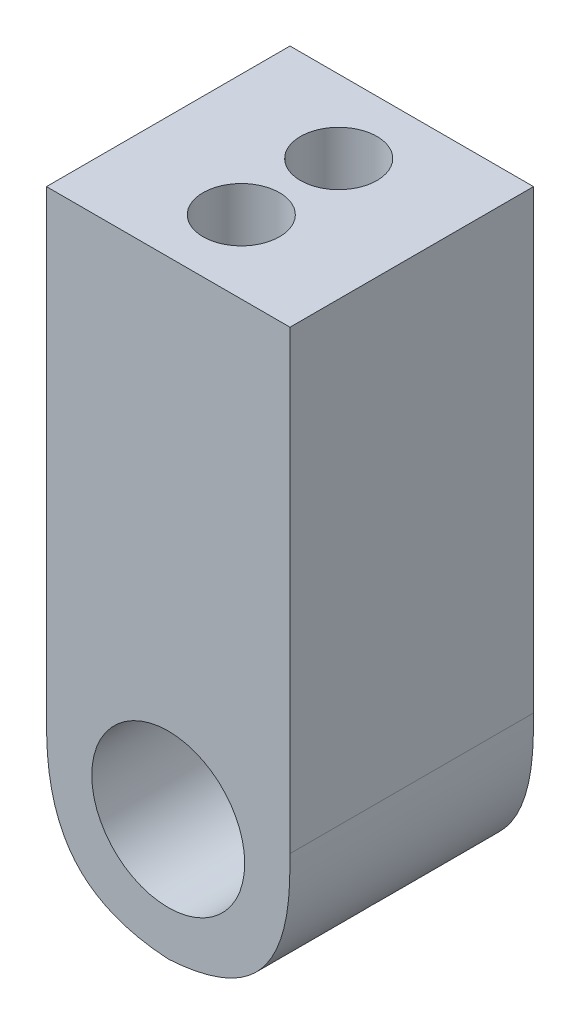
ISO-10303-21;
HEADER;
FILE_DESCRIPTION(('STEP AP214'),'2;1');
FILE_NAME('part.step','',(''),(''),'','','');
FILE_SCHEMA(('AUTOMOTIVE_DESIGN { 1 0 10303 214 1 1 1 1 }'));
ENDSEC;
DATA;
#1=APPLICATION_CONTEXT('core data for automotive mechanical design processes');
#2=APPLICATION_PROTOCOL_DEFINITION('international standard','automotive_design',2000,#1);
#3=PRODUCT_CONTEXT('',#1,'mechanical');
#4=PRODUCT('Part','Part','',(#3));
#5=PRODUCT_RELATED_PRODUCT_CATEGORY('part','',(#4));
#6=PRODUCT_DEFINITION_FORMATION('','',#4);
#7=PRODUCT_DEFINITION_CONTEXT('part definition',#1,'design');
#8=PRODUCT_DEFINITION('design','',#6,#7);
#9=PRODUCT_DEFINITION_SHAPE('','',#8);
#10=(LENGTH_UNIT() NAMED_UNIT(*) SI_UNIT(.MILLI.,.METRE.));
#11=(NAMED_UNIT(*) PLANE_ANGLE_UNIT() SI_UNIT($,.RADIAN.));
#12=(NAMED_UNIT(*) SI_UNIT($,.STERADIAN.) SOLID_ANGLE_UNIT());
#13=UNCERTAINTY_MEASURE_WITH_UNIT(LENGTH_MEASURE(1.E-05),#10,'distance_accuracy_value','');
#14=(GEOMETRIC_REPRESENTATION_CONTEXT(3) GLOBAL_UNCERTAINTY_ASSIGNED_CONTEXT((#13)) GLOBAL_UNIT_ASSIGNED_CONTEXT((#10,
#11,#12)) REPRESENTATION_CONTEXT('',''));
#15=CARTESIAN_POINT('',(0.,0.,0.));
#16=DIRECTION('',(0.,0.,1.));
#17=DIRECTION('',(1.,0.,0.));
#18=AXIS2_PLACEMENT_3D('',#15,#16,#17);
#19=CARTESIAN_POINT('',(-6.35,0.,-12.7));
#20=DIRECTION('',(1.,0.,0.));
#21=DIRECTION('',(0.,0.,-1.));
#22=AXIS2_PLACEMENT_3D('',#19,#20,#21);
#23=PLANE('',#22);
#24=DIRECTION('',(0.,1.,0.));
#25=VECTOR('',#24,1.);
#26=CARTESIAN_POINT('',(-6.35,0.,-12.7));
#27=LINE('',#26,#25);
#28=CARTESIAN_POINT('',(-6.35,1.6256,-12.7));
#29=VERTEX_POINT('',#28);
#30=CARTESIAN_POINT('',(-6.35,25.4,-12.7));
#31=VERTEX_POINT('',#30);
#32=EDGE_CURVE('E105',#29,#31,#27,.T.);
#33=ORIENTED_EDGE('',*,*,#32,.F.);
#34=CARTESIAN_POINT('',(-6.35,1.6256,0.635));
#35=CARTESIAN_POINT('',(-6.35,1.6256,-4.02166666666667));
#36=CARTESIAN_POINT('',(-6.35,1.6256,-8.67833333332475));
#37=CARTESIAN_POINT('',(-6.35,1.6256,-13.335));
#38=B_SPLINE_CURVE_WITH_KNOTS('',3,(#34,#35,#36,#37),.UNSPECIFIED.,.F.,.F.,(4,4),(-0.013335,
0.000635),.UNSPECIFIED.);
#39=CARTESIAN_POINT('',(-6.35,1.6256,0.));
#40=VERTEX_POINT('',#39);
#41=EDGE_CURVE('E122',#29,#40,#38,.F.);
#42=ORIENTED_EDGE('',*,*,#41,.T.);
#43=DIRECTION('',(0.,1.,0.));
#44=VECTOR('',#43,1.);
#45=CARTESIAN_POINT('',(-6.35,0.,0.));
#46=LINE('',#45,#44);
#47=CARTESIAN_POINT('',(-6.35,25.4,0.));
#48=VERTEX_POINT('',#47);
#49=EDGE_CURVE('E126',#40,#48,#46,.T.);
#50=ORIENTED_EDGE('',*,*,#49,.T.);
#51=DIRECTION('',(0.,0.,1.));
#52=VECTOR('',#51,1.);
#53=CARTESIAN_POINT('',(-6.35,25.4,-12.7));
#54=LINE('',#53,#52);
#55=EDGE_CURVE('E119',#31,#48,#54,.T.);
#56=ORIENTED_EDGE('',*,*,#55,.F.);
#57=EDGE_LOOP('',(#33,#42,#50,#56));
#58=FACE_BOUND('',#57,.T.);
#59=ADVANCED_FACE('F44',(#58),#23,.F.);
#60=CARTESIAN_POINT('',(0.,25.4,-12.7));
#61=DIRECTION('',(0.,-1.,0.));
#62=DIRECTION('',(0.,0.,-1.));
#63=AXIS2_PLACEMENT_3D('',#60,#61,#62);
#64=PLANE('',#63);
#65=CARTESIAN_POINT('',(0.,25.4,-8.89));
#66=DIRECTION('',(0.,1.,0.));
#67=DIRECTION('',(0.,0.,1.));
#68=AXIS2_PLACEMENT_3D('',#65,#66,#67);
#69=CIRCLE('',#68,1.9939);
#70=CARTESIAN_POINT('',(0.,25.4,-6.8961));
#71=VERTEX_POINT('',#70);
#72=EDGE_CURVE('E189',#71,#71,#69,.T.);
#73=ORIENTED_EDGE('',*,*,#72,.F.);
#74=EDGE_LOOP('',(#73));
#75=FACE_BOUND('',#74,.T.);
#76=CARTESIAN_POINT('',(0.,25.4,-3.81));
#77=DIRECTION('',(0.,1.,0.));
#78=DIRECTION('',(0.,0.,1.));
#79=AXIS2_PLACEMENT_3D('',#76,#77,#78);
#80=CIRCLE('',#79,1.9939);
#81=CARTESIAN_POINT('',(0.,25.4,-1.8161));
#82=VERTEX_POINT('',#81);
#83=EDGE_CURVE('E180',#82,#82,#80,.T.);
#84=ORIENTED_EDGE('',*,*,#83,.F.);
#85=EDGE_LOOP('',(#84));
#86=FACE_BOUND('',#85,.T.);
#87=DIRECTION('',(1.,0.,0.));
#88=VECTOR('',#87,1.);
#89=CARTESIAN_POINT('',(0.,25.4,0.));
#90=LINE('',#89,#88);
#91=CARTESIAN_POINT('',(6.35,25.4,0.));
#92=VERTEX_POINT('',#91);
#93=EDGE_CURVE('E117',#48,#92,#90,.T.);
#94=ORIENTED_EDGE('',*,*,#93,.T.);
#95=DIRECTION('',(0.,0.,1.));
#96=VECTOR('',#95,1.);
#97=CARTESIAN_POINT('',(6.35,25.4,-12.7));
#98=LINE('',#97,#96);
#99=CARTESIAN_POINT('',(6.35,25.4,-12.7));
#100=VERTEX_POINT('',#99);
#101=EDGE_CURVE('E101',#100,#92,#98,.T.);
#102=ORIENTED_EDGE('',*,*,#101,.F.);
#103=DIRECTION('',(1.,0.,0.));
#104=VECTOR('',#103,1.);
#105=CARTESIAN_POINT('',(0.,25.4,-12.7));
#106=LINE('',#105,#104);
#107=EDGE_CURVE('E104',#31,#100,#106,.T.);
#108=ORIENTED_EDGE('',*,*,#107,.F.);
#109=ORIENTED_EDGE('',*,*,#55,.T.);
#110=EDGE_LOOP('',(#94,#102,#108,#109));
#111=FACE_BOUND('',#110,.T.);
#112=ADVANCED_FACE('F115',(#75,#86,#111),#64,.F.);
#113=CARTESIAN_POINT('',(6.35,0.,-12.7));
#114=DIRECTION('',(1.,0.,0.));
#115=DIRECTION('',(0.,0.,-1.));
#116=AXIS2_PLACEMENT_3D('',#113,#114,#115);
#117=PLANE('',#116);
#118=DIRECTION('',(0.,1.,0.));
#119=VECTOR('',#118,1.);
#120=CARTESIAN_POINT('',(6.35,0.,0.));
#121=LINE('',#120,#119);
#122=CARTESIAN_POINT('',(6.35,1.6256,0.));
#123=VERTEX_POINT('',#122);
#124=EDGE_CURVE('E130',#123,#92,#121,.T.);
#125=ORIENTED_EDGE('',*,*,#124,.F.);
#126=CARTESIAN_POINT('',(6.35,1.6256,-13.335));
#127=CARTESIAN_POINT('',(6.35,1.6256,-8.67833333332475));
#128=CARTESIAN_POINT('',(6.35,1.6256,-4.02166666666667));
#129=CARTESIAN_POINT('',(6.35,1.6256,0.634999999999998));
#130=B_SPLINE_CURVE_WITH_KNOTS('',3,(#126,#127,#128,#129),.UNSPECIFIED.,.F.,.F.,(4,4),
(-0.000635,0.013335),.UNSPECIFIED.);
#131=CARTESIAN_POINT('',(6.35,1.6256,-12.7));
#132=VERTEX_POINT('',#131);
#133=EDGE_CURVE('E11',#123,#132,#130,.F.);
#134=ORIENTED_EDGE('',*,*,#133,.T.);
#135=DIRECTION('',(0.,1.,0.));
#136=VECTOR('',#135,1.);
#137=CARTESIAN_POINT('',(6.35,0.,-12.7));
#138=LINE('',#137,#136);
#139=EDGE_CURVE('E97',#132,#100,#138,.T.);
#140=ORIENTED_EDGE('',*,*,#139,.T.);
#141=ORIENTED_EDGE('',*,*,#101,.T.);
#142=EDGE_LOOP('',(#125,#134,#140,#141));
#143=FACE_BOUND('',#142,.T.);
#144=ADVANCED_FACE('F99',(#143),#117,.T.);
#145=CARTESIAN_POINT('',(0.,0.,-12.7));
#146=DIRECTION('',(0.,0.,1.));
#147=DIRECTION('',(1.,0.,0.));
#148=AXIS2_PLACEMENT_3D('',#145,#146,#147);
#149=PLANE('',#148);
#150=CARTESIAN_POINT('',(-1.6256,-6.35,-12.7));
#151=CARTESIAN_POINT('',(-0.284119620185859,-6.35,-12.7));
#152=CARTESIAN_POINT('',(1.05736075962828,-6.35,-12.7));
#153=CARTESIAN_POINT('',(4.01400084403143,-5.77821392415533,-12.7));
#154=CARTESIAN_POINT('',(5.77821392415533,-4.01400084403143,-12.7));
#155=CARTESIAN_POINT('',(6.35,-1.05736075962829,-12.7));
#156=CARTESIAN_POINT('',(6.35,0.284119620185857,-12.7));
#157=CARTESIAN_POINT('',(6.35,1.6256,-12.7));
#158=B_SPLINE_CURVE_WITH_KNOTS('',5,(#150,#151,#152,#153,#154,#155,#156,#157),.UNSPECIFIED.,.F.,
.F.,(6,2,6),(0.,0.5,1.),.UNSPECIFIED.);
#159=CARTESIAN_POINT('',(-7.25062341599403E-07,-6.3144499642676,-12.7));
#160=VERTEX_POINT('',#159);
#161=EDGE_CURVE('E66',#132,#160,#158,.F.);
#162=ORIENTED_EDGE('',*,*,#161,.T.);
#163=CARTESIAN_POINT('',(-6.35,1.6256,-12.7));
#164=CARTESIAN_POINT('',(-6.35,0.284119620185856,-12.7));
#165=CARTESIAN_POINT('',(-6.35,-1.05736075962829,-12.7));
#166=CARTESIAN_POINT('',(-5.77821392415534,-4.01400084403143,-12.7));
#167=CARTESIAN_POINT('',(-4.01400084403143,-5.77821392415533,-12.7));
#168=CARTESIAN_POINT('',(-1.05736075962829,-6.35,-12.7));
#169=CARTESIAN_POINT('',(0.284119620185855,-6.35,-12.7));
#170=CARTESIAN_POINT('',(1.6256,-6.35,-12.7));
#171=B_SPLINE_CURVE_WITH_KNOTS('',5,(#163,#164,#165,#166,#167,#168,#169,#170),.UNSPECIFIED.,.F.,
.F.,(6,2,6),(0.,0.5,1.),.UNSPECIFIED.);
#172=EDGE_CURVE('E59',#160,#29,#171,.F.);
#173=ORIENTED_EDGE('',*,*,#172,.T.);
#174=ORIENTED_EDGE('',*,*,#32,.T.);
#175=ORIENTED_EDGE('',*,*,#107,.T.);
#176=ORIENTED_EDGE('',*,*,#139,.F.);
#177=EDGE_LOOP('',(#162,#173,#174,#175,#176));
#178=FACE_BOUND('',#177,.T.);
#179=ADVANCED_FACE('F108',(#178),#149,.F.);
#180=CARTESIAN_POINT('',(0.,0.,0.));
#181=DIRECTION('',(0.,0.,1.));
#182=DIRECTION('',(1.,0.,0.));
#183=AXIS2_PLACEMENT_3D('',#180,#181,#182);
#184=PLANE('',#183);
#185=CARTESIAN_POINT('',(0.,0.,0.));
#186=DIRECTION('',(0.,0.,1.));
#187=DIRECTION('',(1.,0.,0.));
#188=AXIS2_PLACEMENT_3D('',#185,#186,#187);
#189=CIRCLE('',#188,3.9878);
#190=CARTESIAN_POINT('',(3.9878,0.,0.));
#191=VERTEX_POINT('',#190);
#192=EDGE_CURVE('E197',#191,#191,#189,.T.);
#193=ORIENTED_EDGE('',*,*,#192,.F.);
#194=EDGE_LOOP('',(#193));
#195=FACE_BOUND('',#194,.T.);
#196=ORIENTED_EDGE('',*,*,#49,.F.);
#197=CARTESIAN_POINT('',(1.6256,-6.35,0.));
#198=CARTESIAN_POINT('',(0.284119620185855,-6.35,0.));
#199=CARTESIAN_POINT('',(-1.05736075962829,-6.35,0.));
#200=CARTESIAN_POINT('',(-4.01400084403143,-5.77821392415533,0.));
#201=CARTESIAN_POINT('',(-5.77821392415534,-4.01400084403143,0.));
#202=CARTESIAN_POINT('',(-6.35,-1.05736075962829,0.));
#203=CARTESIAN_POINT('',(-6.35,0.284119620185856,0.));
#204=CARTESIAN_POINT('',(-6.35,1.6256,0.));
#205=B_SPLINE_CURVE_WITH_KNOTS('',5,(#197,#198,#199,#200,#201,#202,#203,#204),.UNSPECIFIED.,.F.,
.F.,(6,2,6),(0.,0.5,1.),.UNSPECIFIED.);
#206=CARTESIAN_POINT('',(-4.50984004952076E-07,-6.31445417406303,0.));
#207=VERTEX_POINT('',#206);
#208=EDGE_CURVE('E214',#40,#207,#205,.F.);
#209=ORIENTED_EDGE('',*,*,#208,.T.);
#210=CARTESIAN_POINT('',(6.35,1.6256,0.));
#211=CARTESIAN_POINT('',(6.35,0.284119620185857,0.));
#212=CARTESIAN_POINT('',(6.35,-1.05736075962829,0.));
#213=CARTESIAN_POINT('',(5.77821392415533,-4.01400084403143,0.));
#214=CARTESIAN_POINT('',(4.01400084403143,-5.77821392415533,0.));
#215=CARTESIAN_POINT('',(1.05736075962828,-6.35,0.));
#216=CARTESIAN_POINT('',(-0.284119620185859,-6.35,0.));
#217=CARTESIAN_POINT('',(-1.6256,-6.35,0.));
#218=B_SPLINE_CURVE_WITH_KNOTS('',5,(#210,#211,#212,#213,#214,#215,#216,#217),.UNSPECIFIED.,.F.,
.F.,(6,2,6),(0.,0.5,1.),.UNSPECIFIED.);
#219=EDGE_CURVE('E148',#207,#123,#218,.F.);
#220=ORIENTED_EDGE('',*,*,#219,.T.);
#221=ORIENTED_EDGE('',*,*,#124,.T.);
#222=ORIENTED_EDGE('',*,*,#93,.F.);
#223=EDGE_LOOP('',(#196,#209,#220,#221,#222));
#224=FACE_BOUND('',#223,.T.);
#225=ADVANCED_FACE('F154',(#195,#224),#184,.T.);
#226=CARTESIAN_POINT('',(-1.6256,-6.35,-13.335));
#227=CARTESIAN_POINT('',(-1.6256,-6.35,-8.67833333332475));
#228=CARTESIAN_POINT('',(-1.6256,-6.35,-4.02166666666667));
#229=CARTESIAN_POINT('',(-1.6256,-6.35,0.634999999999998));
#230=CARTESIAN_POINT('',(-0.284119620185859,-6.35,-13.335));
#231=CARTESIAN_POINT('',(-0.284119620185859,-6.35,-8.67833333332475));
#232=CARTESIAN_POINT('',(-0.284119620185859,-6.35,-4.02166666666667));
#233=CARTESIAN_POINT('',(-0.284119620185859,-6.35,0.634999999999998));
#234=CARTESIAN_POINT('',(1.05736075962828,-6.35,-13.335));
#235=CARTESIAN_POINT('',(1.05736075962828,-6.35,-8.67833333332475));
#236=CARTESIAN_POINT('',(1.05736075962828,-6.35,-4.02166666666667));
#237=CARTESIAN_POINT('',(1.05736075962828,-6.35,0.634999999999998));
#238=CARTESIAN_POINT('',(4.01400084403143,-5.77821392415533,-13.335));
#239=CARTESIAN_POINT('',(4.01400084403143,-5.77821392415533,-8.67833333332475));
#240=CARTESIAN_POINT('',(4.01400084403143,-5.77821392415533,-4.02166666666667));
#241=CARTESIAN_POINT('',(4.01400084403143,-5.77821392415533,0.634999999999998));
#242=CARTESIAN_POINT('',(5.77821392415533,-4.01400084403143,-13.335));
#243=CARTESIAN_POINT('',(5.77821392415533,-4.01400084403143,-8.67833333332475));
#244=CARTESIAN_POINT('',(5.77821392415533,-4.01400084403143,-4.02166666666667));
#245=CARTESIAN_POINT('',(5.77821392415533,-4.01400084403143,0.634999999999998));
#246=CARTESIAN_POINT('',(6.35,-1.05736075962829,-13.335));
#247=CARTESIAN_POINT('',(6.35,-1.05736075962829,-8.67833333332475));
#248=CARTESIAN_POINT('',(6.35,-1.05736075962829,-4.02166666666667));
#249=CARTESIAN_POINT('',(6.35,-1.05736075962829,0.634999999999998));
#250=CARTESIAN_POINT('',(6.35,0.284119620185857,-13.335));
#251=CARTESIAN_POINT('',(6.35,0.284119620185857,-8.67833333332475));
#252=CARTESIAN_POINT('',(6.35,0.284119620185857,-4.02166666666667));
#253=CARTESIAN_POINT('',(6.35,0.284119620185857,0.634999999999998));
#254=CARTESIAN_POINT('',(6.35,1.6256,-13.335));
#255=CARTESIAN_POINT('',(6.35,1.6256,-8.67833333332475));
#256=CARTESIAN_POINT('',(6.35,1.6256,-4.02166666666667));
#257=CARTESIAN_POINT('',(6.35,1.6256,0.634999999999998));
#258=B_SPLINE_SURFACE_WITH_KNOTS('',5,3,((#226,#227,#228,#229),(#230,#231,#232,#233),(#234,#235,
#236,#237),(#238,#239,#240,#241),(#242,#243,#244,#245),(#246,#247,#248,#249),(#250,#251,#252,
#253),(#254,#255,#256,#257)),.UNSPECIFIED.,.F.,.F.,.F.,(6,2,6),(4,4),(0.,0.5,1.),(-0.000635,
0.013335),.UNSPECIFIED.);
#259=CARTESIAN_POINT('',(0.,-6.31446149156776,-13.335));
#260=CARTESIAN_POINT('',(0.,-6.31446149156776,-8.67833333332475));
#261=CARTESIAN_POINT('',(0.,-6.31446149156776,-4.02166666666667));
#262=CARTESIAN_POINT('',(0.,-6.31446149156776,0.635));
#263=B_SPLINE_CURVE_WITH_KNOTS('',3,(#259,#260,#261,#262),.UNSPECIFIED.,.F.,.F.,(4,4),
(-0.013335,0.000635),.UNSPECIFIED.);
#264=EDGE_CURVE('E131',#160,#207,#263,.T.);
#265=ORIENTED_EDGE('',*,*,#264,.F.);
#266=ORIENTED_EDGE('',*,*,#161,.F.);
#267=ORIENTED_EDGE('',*,*,#133,.F.);
#268=ORIENTED_EDGE('',*,*,#219,.F.);
#269=EDGE_LOOP('',(#265,#266,#267,#268));
#270=FACE_BOUND('',#269,.T.);
#271=ADVANCED_FACE('F47',(#270),#258,.T.);
#272=CARTESIAN_POINT('',(1.6256,-6.35,0.635));
#273=CARTESIAN_POINT('',(1.6256,-6.35,-4.02166666666667));
#274=CARTESIAN_POINT('',(1.6256,-6.35,-8.67833333332475));
#275=CARTESIAN_POINT('',(1.6256,-6.35,-13.335));
#276=CARTESIAN_POINT('',(0.284119620185855,-6.35,0.635));
#277=CARTESIAN_POINT('',(0.284119620185855,-6.35,-4.02166666666667));
#278=CARTESIAN_POINT('',(0.284119620185855,-6.35,-8.67833333332475));
#279=CARTESIAN_POINT('',(0.284119620185855,-6.35,-13.335));
#280=CARTESIAN_POINT('',(-1.05736075962829,-6.35,0.635));
#281=CARTESIAN_POINT('',(-1.05736075962829,-6.35,-4.02166666666667));
#282=CARTESIAN_POINT('',(-1.05736075962829,-6.35,-8.67833333332475));
#283=CARTESIAN_POINT('',(-1.05736075962829,-6.35,-13.335));
#284=CARTESIAN_POINT('',(-4.01400084403143,-5.77821392415533,0.635));
#285=CARTESIAN_POINT('',(-4.01400084403143,-5.77821392415533,-4.02166666666667));
#286=CARTESIAN_POINT('',(-4.01400084403143,-5.77821392415533,-8.67833333332475));
#287=CARTESIAN_POINT('',(-4.01400084403143,-5.77821392415533,-13.335));
#288=CARTESIAN_POINT('',(-5.77821392415534,-4.01400084403143,0.635));
#289=CARTESIAN_POINT('',(-5.77821392415534,-4.01400084403143,-4.02166666666667));
#290=CARTESIAN_POINT('',(-5.77821392415534,-4.01400084403143,-8.67833333332475));
#291=CARTESIAN_POINT('',(-5.77821392415534,-4.01400084403143,-13.335));
#292=CARTESIAN_POINT('',(-6.35,-1.05736075962829,0.635));
#293=CARTESIAN_POINT('',(-6.35,-1.05736075962829,-4.02166666666667));
#294=CARTESIAN_POINT('',(-6.35,-1.05736075962829,-8.67833333332475));
#295=CARTESIAN_POINT('',(-6.35,-1.05736075962829,-13.335));
#296=CARTESIAN_POINT('',(-6.35,0.284119620185856,0.635));
#297=CARTESIAN_POINT('',(-6.35,0.284119620185856,-4.02166666666667));
#298=CARTESIAN_POINT('',(-6.35,0.284119620185856,-8.67833333332475));
#299=CARTESIAN_POINT('',(-6.35,0.284119620185856,-13.335));
#300=CARTESIAN_POINT('',(-6.35,1.6256,0.635));
#301=CARTESIAN_POINT('',(-6.35,1.6256,-4.02166666666667));
#302=CARTESIAN_POINT('',(-6.35,1.6256,-8.67833333332475));
#303=CARTESIAN_POINT('',(-6.35,1.6256,-13.335));
#304=B_SPLINE_SURFACE_WITH_KNOTS('',5,3,((#272,#273,#274,#275),(#276,#277,#278,#279),(#280,#281,
#282,#283),(#284,#285,#286,#287),(#288,#289,#290,#291),(#292,#293,#294,#295),(#296,#297,#298,
#299),(#300,#301,#302,#303)),.UNSPECIFIED.,.F.,.F.,.F.,(6,2,6),(4,4),(0.,0.5,1.),(-0.013335,
0.000635),.UNSPECIFIED.);
#305=ORIENTED_EDGE('',*,*,#172,.F.);
#306=ORIENTED_EDGE('',*,*,#264,.T.);
#307=ORIENTED_EDGE('',*,*,#208,.F.);
#308=ORIENTED_EDGE('',*,*,#41,.F.);
#309=EDGE_LOOP('',(#305,#306,#307,#308));
#310=FACE_BOUND('',#309,.T.);
#311=ADVANCED_FACE('F254',(#310),#304,.T.);
#312=CARTESIAN_POINT('',(0.,19.05,-3.81));
#313=DIRECTION('',(0.,1.,0.));
#314=DIRECTION('',(0.,0.,1.));
#315=AXIS2_PLACEMENT_3D('',#312,#313,#314);
#316=CYLINDRICAL_SURFACE('',#315,1.9939);
#317=CARTESIAN_POINT('',(0.,19.05,-3.81));
#318=DIRECTION('',(0.,1.,0.));
#319=DIRECTION('',(0.,0.,1.));
#320=AXIS2_PLACEMENT_3D('',#317,#318,#319);
#321=CIRCLE('',#320,1.9939);
#322=CARTESIAN_POINT('',(0.,19.05,-1.8161));
#323=VERTEX_POINT('',#322);
#324=EDGE_CURVE('E184',#323,#323,#321,.T.);
#325=ORIENTED_EDGE('',*,*,#324,.F.);
#326=EDGE_LOOP('',(#325));
#327=FACE_BOUND('',#326,.T.);
#328=ORIENTED_EDGE('',*,*,#83,.T.);
#329=EDGE_LOOP('',(#328));
#330=FACE_BOUND('',#329,.T.);
#331=ADVANCED_FACE('F261',(#327,#330),#316,.F.);
#332=CARTESIAN_POINT('',(0.,19.05,0.));
#333=DIRECTION('',(0.,1.,0.));
#334=DIRECTION('',(0.,0.,1.));
#335=AXIS2_PLACEMENT_3D('',#332,#333,#334);
#336=PLANE('',#335);
#337=ORIENTED_EDGE('',*,*,#324,.T.);
#338=EDGE_LOOP('',(#337));
#339=FACE_BOUND('',#338,.T.);
#340=ADVANCED_FACE('F338',(#339),#336,.T.);
#341=CARTESIAN_POINT('',(0.,19.05,-8.89));
#342=DIRECTION('',(0.,1.,0.));
#343=DIRECTION('',(0.,0.,1.));
#344=AXIS2_PLACEMENT_3D('',#341,#342,#343);
#345=CYLINDRICAL_SURFACE('',#344,1.9939);
#346=CARTESIAN_POINT('',(0.,19.05,-8.89));
#347=DIRECTION('',(0.,1.,0.));
#348=DIRECTION('',(0.,0.,1.));
#349=AXIS2_PLACEMENT_3D('',#346,#347,#348);
#350=CIRCLE('',#349,1.9939);
#351=CARTESIAN_POINT('',(0.,19.05,-6.8961));
#352=VERTEX_POINT('',#351);
#353=EDGE_CURVE('E193',#352,#352,#350,.T.);
#354=ORIENTED_EDGE('',*,*,#353,.F.);
#355=EDGE_LOOP('',(#354));
#356=FACE_BOUND('',#355,.T.);
#357=ORIENTED_EDGE('',*,*,#72,.T.);
#358=EDGE_LOOP('',(#357));
#359=FACE_BOUND('',#358,.T.);
#360=ADVANCED_FACE('F345',(#356,#359),#345,.F.);
#361=CARTESIAN_POINT('',(0.,19.05,0.));
#362=DIRECTION('',(0.,1.,0.));
#363=DIRECTION('',(0.,0.,1.));
#364=AXIS2_PLACEMENT_3D('',#361,#362,#363);
#365=PLANE('',#364);
#366=ORIENTED_EDGE('',*,*,#353,.T.);
#367=EDGE_LOOP('',(#366));
#368=FACE_BOUND('',#367,.T.);
#369=ADVANCED_FACE('F210',(#368),#365,.T.);
#370=CARTESIAN_POINT('',(0.,0.,-6.35));
#371=DIRECTION('',(0.,0.,1.));
#372=DIRECTION('',(1.,0.,0.));
#373=AXIS2_PLACEMENT_3D('',#370,#371,#372);
#374=CYLINDRICAL_SURFACE('',#373,3.9878);
#375=CARTESIAN_POINT('',(0.,0.,-6.35));
#376=DIRECTION('',(0.,0.,1.));
#377=DIRECTION('',(1.,0.,0.));
#378=AXIS2_PLACEMENT_3D('',#375,#376,#377);
#379=CIRCLE('',#378,3.9878);
#380=CARTESIAN_POINT('',(3.9878,0.,-6.35));
#381=VERTEX_POINT('',#380);
#382=EDGE_CURVE('E185',#381,#381,#379,.T.);
#383=ORIENTED_EDGE('',*,*,#382,.F.);
#384=EDGE_LOOP('',(#383));
#385=FACE_BOUND('',#384,.T.);
#386=ORIENTED_EDGE('',*,*,#192,.T.);
#387=EDGE_LOOP('',(#386));
#388=FACE_BOUND('',#387,.T.);
#389=ADVANCED_FACE('F207',(#385,#388),#374,.F.);
#390=CARTESIAN_POINT('',(0.,0.,-6.35));
#391=DIRECTION('',(0.,0.,1.));
#392=DIRECTION('',(1.,0.,0.));
#393=AXIS2_PLACEMENT_3D('',#390,#391,#392);
#394=PLANE('',#393);
#395=ORIENTED_EDGE('',*,*,#382,.T.);
#396=EDGE_LOOP('',(#395));
#397=FACE_BOUND('',#396,.T.);
#398=ADVANCED_FACE('F205',(#397),#394,.T.);
#399=CLOSED_SHELL('',(#59,#112,#144,#179,#225,#271,#311,#331,#340,#360,#369,#389,#398));
#400=MANIFOLD_SOLID_BREP('B2',#399);
#401=ADVANCED_BREP_SHAPE_REPRESENTATION('',(#18,#400),#14);
#402=SHAPE_DEFINITION_REPRESENTATION(#9,#401);
ENDSEC;
END-ISO-10303-21;
